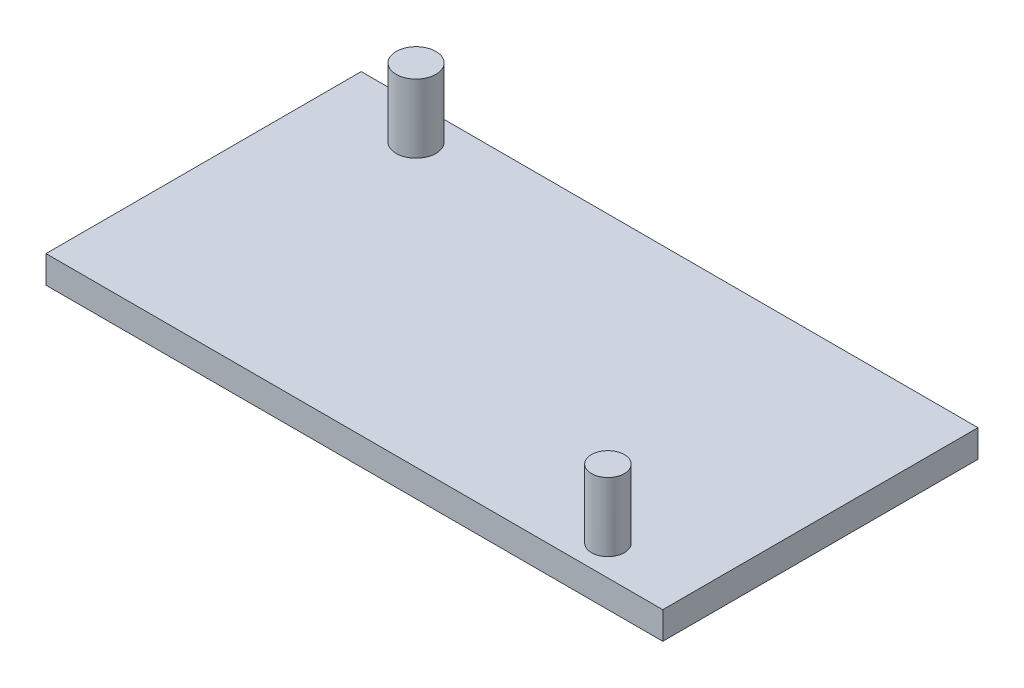
ISO-10303-21;
HEADER;
FILE_DESCRIPTION(('STEP AP214'),'2;1');
FILE_NAME('part.step','',(''),(''),'','','');
FILE_SCHEMA(('AUTOMOTIVE_DESIGN { 1 0 10303 214 1 1 1 1 }'));
ENDSEC;
DATA;
#1=APPLICATION_CONTEXT('core data for automotive mechanical design processes');
#2=APPLICATION_PROTOCOL_DEFINITION('international standard','automotive_design',2000,#1);
#3=PRODUCT_CONTEXT('',#1,'mechanical');
#4=PRODUCT('Part','Part','',(#3));
#5=PRODUCT_RELATED_PRODUCT_CATEGORY('part','',(#4));
#6=PRODUCT_DEFINITION_FORMATION('','',#4);
#7=PRODUCT_DEFINITION_CONTEXT('part definition',#1,'design');
#8=PRODUCT_DEFINITION('design','',#6,#7);
#9=PRODUCT_DEFINITION_SHAPE('','',#8);
#10=(LENGTH_UNIT() NAMED_UNIT(*) SI_UNIT(.MILLI.,.METRE.));
#11=(NAMED_UNIT(*) PLANE_ANGLE_UNIT() SI_UNIT($,.RADIAN.));
#12=(NAMED_UNIT(*) SI_UNIT($,.STERADIAN.) SOLID_ANGLE_UNIT());
#13=UNCERTAINTY_MEASURE_WITH_UNIT(LENGTH_MEASURE(1.E-05),#10,'distance_accuracy_value','');
#14=(GEOMETRIC_REPRESENTATION_CONTEXT(3) GLOBAL_UNCERTAINTY_ASSIGNED_CONTEXT((#13)) GLOBAL_UNIT_ASSIGNED_CONTEXT((#10,
#11,#12)) REPRESENTATION_CONTEXT('',''));
#15=CARTESIAN_POINT('',(0.,0.,0.));
#16=DIRECTION('',(0.,0.,1.));
#17=DIRECTION('',(1.,0.,0.));
#18=AXIS2_PLACEMENT_3D('',#15,#16,#17);
#19=CARTESIAN_POINT('',(0.,-2.,0.));
#20=DIRECTION('',(-1.,0.,0.));
#21=DIRECTION('',(0.,0.,1.));
#22=AXIS2_PLACEMENT_3D('',#19,#20,#21);
#23=PLANE('',#22);
#24=DIRECTION('',(0.,0.,1.));
#25=VECTOR('',#24,1.);
#26=CARTESIAN_POINT('',(0.,0.,0.));
#27=LINE('',#26,#25);
#28=CARTESIAN_POINT('',(0.,0.,-23.));
#29=VERTEX_POINT('',#28);
#30=CARTESIAN_POINT('',(0.,0.,0.));
#31=VERTEX_POINT('',#30);
#32=EDGE_CURVE('E101',#29,#31,#27,.T.);
#33=ORIENTED_EDGE('',*,*,#32,.F.);
#34=DIRECTION('',(0.,1.,0.));
#35=VECTOR('',#34,1.);
#36=CARTESIAN_POINT('',(0.,-2.,-23.));
#37=LINE('',#36,#35);
#38=CARTESIAN_POINT('',(0.,-2.,-23.));
#39=VERTEX_POINT('',#38);
#40=EDGE_CURVE('E49',#39,#29,#37,.T.);
#41=ORIENTED_EDGE('',*,*,#40,.F.);
#42=DIRECTION('',(0.,0.,1.));
#43=VECTOR('',#42,1.);
#44=CARTESIAN_POINT('',(0.,-2.,0.));
#45=LINE('',#44,#43);
#46=CARTESIAN_POINT('',(0.,-2.,0.));
#47=VERTEX_POINT('',#46);
#48=EDGE_CURVE('E94',#39,#47,#45,.T.);
#49=ORIENTED_EDGE('',*,*,#48,.T.);
#50=DIRECTION('',(0.,1.,0.));
#51=VECTOR('',#50,1.);
#52=CARTESIAN_POINT('',(0.,-2.,0.));
#53=LINE('',#52,#51);
#54=EDGE_CURVE('E77',#47,#31,#53,.T.);
#55=ORIENTED_EDGE('',*,*,#54,.T.);
#56=EDGE_LOOP('',(#33,#41,#49,#55));
#57=FACE_BOUND('',#56,.T.);
#58=ADVANCED_FACE('F33',(#57),#23,.T.);
#59=CARTESIAN_POINT('',(0.,-2.,-23.));
#60=DIRECTION('',(0.,0.,-1.));
#61=DIRECTION('',(-1.,0.,0.));
#62=AXIS2_PLACEMENT_3D('',#59,#60,#61);
#63=PLANE('',#62);
#64=DIRECTION('',(-1.,0.,0.));
#65=VECTOR('',#64,1.);
#66=CARTESIAN_POINT('',(0.,0.,-23.));
#67=LINE('',#66,#65);
#68=CARTESIAN_POINT('',(45.,0.,-23.));
#69=VERTEX_POINT('',#68);
#70=EDGE_CURVE('E96',#69,#29,#67,.T.);
#71=ORIENTED_EDGE('',*,*,#70,.F.);
#72=DIRECTION('',(0.,1.,0.));
#73=VECTOR('',#72,1.);
#74=CARTESIAN_POINT('',(45.,-2.,-23.));
#75=LINE('',#74,#73);
#76=CARTESIAN_POINT('',(45.,-2.,-23.));
#77=VERTEX_POINT('',#76);
#78=EDGE_CURVE('E66',#77,#69,#75,.T.);
#79=ORIENTED_EDGE('',*,*,#78,.F.);
#80=DIRECTION('',(-1.,0.,0.));
#81=VECTOR('',#80,1.);
#82=CARTESIAN_POINT('',(0.,-2.,-23.));
#83=LINE('',#82,#81);
#84=EDGE_CURVE('E91',#77,#39,#83,.T.);
#85=ORIENTED_EDGE('',*,*,#84,.T.);
#86=ORIENTED_EDGE('',*,*,#40,.T.);
#87=EDGE_LOOP('',(#71,#79,#85,#86));
#88=FACE_BOUND('',#87,.T.);
#89=ADVANCED_FACE('F122',(#88),#63,.T.);
#90=CARTESIAN_POINT('',(45.,-2.,0.));
#91=DIRECTION('',(1.,0.,0.));
#92=DIRECTION('',(0.,0.,-1.));
#93=AXIS2_PLACEMENT_3D('',#90,#91,#92);
#94=PLANE('',#93);
#95=DIRECTION('',(0.,0.,-1.));
#96=VECTOR('',#95,1.);
#97=CARTESIAN_POINT('',(45.,0.,0.));
#98=LINE('',#97,#96);
#99=CARTESIAN_POINT('',(45.,0.,0.));
#100=VERTEX_POINT('',#99);
#101=EDGE_CURVE('E85',#100,#69,#98,.T.);
#102=ORIENTED_EDGE('',*,*,#101,.F.);
#103=DIRECTION('',(0.,1.,0.));
#104=VECTOR('',#103,1.);
#105=CARTESIAN_POINT('',(45.,-2.,0.));
#106=LINE('',#105,#104);
#107=CARTESIAN_POINT('',(45.,-2.,0.));
#108=VERTEX_POINT('',#107);
#109=EDGE_CURVE('E80',#108,#100,#106,.T.);
#110=ORIENTED_EDGE('',*,*,#109,.F.);
#111=DIRECTION('',(0.,0.,-1.));
#112=VECTOR('',#111,1.);
#113=CARTESIAN_POINT('',(45.,-2.,0.));
#114=LINE('',#113,#112);
#115=EDGE_CURVE('E83',#108,#77,#114,.T.);
#116=ORIENTED_EDGE('',*,*,#115,.T.);
#117=ORIENTED_EDGE('',*,*,#78,.T.);
#118=EDGE_LOOP('',(#102,#110,#116,#117));
#119=FACE_BOUND('',#118,.T.);
#120=ADVANCED_FACE('F82',(#119),#94,.T.);
#121=CARTESIAN_POINT('',(0.,-2.,0.));
#122=DIRECTION('',(0.,0.,1.));
#123=DIRECTION('',(1.,0.,0.));
#124=AXIS2_PLACEMENT_3D('',#121,#122,#123);
#125=PLANE('',#124);
#126=DIRECTION('',(1.,0.,0.));
#127=VECTOR('',#126,1.);
#128=CARTESIAN_POINT('',(0.,0.,0.));
#129=LINE('',#128,#127);
#130=EDGE_CURVE('E104',#31,#100,#129,.T.);
#131=ORIENTED_EDGE('',*,*,#130,.F.);
#132=ORIENTED_EDGE('',*,*,#54,.F.);
#133=DIRECTION('',(1.,0.,0.));
#134=VECTOR('',#133,1.);
#135=CARTESIAN_POINT('',(0.,-2.,0.));
#136=LINE('',#135,#134);
#137=EDGE_CURVE('E90',#47,#108,#136,.T.);
#138=ORIENTED_EDGE('',*,*,#137,.T.);
#139=ORIENTED_EDGE('',*,*,#109,.T.);
#140=EDGE_LOOP('',(#131,#132,#138,#139));
#141=FACE_BOUND('',#140,.T.);
#142=ADVANCED_FACE('F93',(#141),#125,.T.);
#143=CARTESIAN_POINT('',(0.,-2.,0.));
#144=DIRECTION('',(0.,-1.,0.));
#145=DIRECTION('',(0.,0.,-1.));
#146=AXIS2_PLACEMENT_3D('',#143,#144,#145);
#147=PLANE('',#146);
#148=ORIENTED_EDGE('',*,*,#48,.F.);
#149=ORIENTED_EDGE('',*,*,#84,.F.);
#150=ORIENTED_EDGE('',*,*,#115,.F.);
#151=ORIENTED_EDGE('',*,*,#137,.F.);
#152=EDGE_LOOP('',(#148,#149,#150,#151));
#153=FACE_BOUND('',#152,.T.);
#154=ADVANCED_FACE('F89',(#153),#147,.T.);
#155=CARTESIAN_POINT('',(0.,0.,0.));
#156=DIRECTION('',(0.,-1.,0.));
#157=DIRECTION('',(0.,0.,-1.));
#158=AXIS2_PLACEMENT_3D('',#155,#156,#157);
#159=PLANE('',#158);
#160=CARTESIAN_POINT('',(6.45,0.,-20.5499922));
#161=DIRECTION('',(0.,-1.,0.));
#162=DIRECTION('',(0.,0.,-1.));
#163=AXIS2_PLACEMENT_3D('',#160,#161,#162);
#164=CIRCLE('',#163,1.45);
#165=CARTESIAN_POINT('',(6.45,0.,-21.9999922));
#166=VERTEX_POINT('',#165);
#167=EDGE_CURVE('E11',#166,#166,#164,.F.);
#168=ORIENTED_EDGE('',*,*,#167,.F.);
#169=EDGE_LOOP('',(#168));
#170=FACE_BOUND('',#169,.T.);
#171=CARTESIAN_POINT('',(38.8,0.,-2.2));
#172=DIRECTION('',(0.,-1.,0.));
#173=DIRECTION('',(0.,0.,-1.));
#174=AXIS2_PLACEMENT_3D('',#171,#172,#173);
#175=CIRCLE('',#174,1.1999976);
#176=CARTESIAN_POINT('',(38.8,0.,-3.3999976));
#177=VERTEX_POINT('',#176);
#178=EDGE_CURVE('E41',#177,#177,#175,.F.);
#179=ORIENTED_EDGE('',*,*,#178,.F.);
#180=EDGE_LOOP('',(#179));
#181=FACE_BOUND('',#180,.T.);
#182=ORIENTED_EDGE('',*,*,#32,.T.);
#183=ORIENTED_EDGE('',*,*,#130,.T.);
#184=ORIENTED_EDGE('',*,*,#101,.T.);
#185=ORIENTED_EDGE('',*,*,#70,.T.);
#186=EDGE_LOOP('',(#182,#183,#184,#185));
#187=FACE_BOUND('',#186,.T.);
#188=ADVANCED_FACE('F117',(#170,#181,#187),#159,.F.);
#189=CARTESIAN_POINT('',(38.8,5.,-2.2));
#190=DIRECTION('',(0.,-1.,0.));
#191=DIRECTION('',(0.,0.,-1.));
#192=AXIS2_PLACEMENT_3D('',#189,#190,#191);
#193=CYLINDRICAL_SURFACE('',#192,1.1999976);
#194=CARTESIAN_POINT('',(38.8,5.,-2.2));
#195=DIRECTION('',(0.,1.,0.));
#196=DIRECTION('',(0.,0.,1.));
#197=AXIS2_PLACEMENT_3D('',#194,#195,#196);
#198=CIRCLE('',#197,1.1999976);
#199=CARTESIAN_POINT('',(38.8,5.,-1.0000024));
#200=VERTEX_POINT('',#199);
#201=EDGE_CURVE('E105',#200,#200,#198,.T.);
#202=ORIENTED_EDGE('',*,*,#201,.F.);
#203=EDGE_LOOP('',(#202));
#204=FACE_BOUND('',#203,.T.);
#205=ORIENTED_EDGE('',*,*,#178,.T.);
#206=EDGE_LOOP('',(#205));
#207=FACE_BOUND('',#206,.T.);
#208=ADVANCED_FACE('F115',(#204,#207),#193,.T.);
#209=CARTESIAN_POINT('',(38.8,5.,-2.2));
#210=DIRECTION('',(0.,1.,0.));
#211=DIRECTION('',(0.,0.,1.));
#212=AXIS2_PLACEMENT_3D('',#209,#210,#211);
#213=PLANE('',#212);
#214=ORIENTED_EDGE('',*,*,#201,.T.);
#215=EDGE_LOOP('',(#214));
#216=FACE_BOUND('',#215,.T.);
#217=ADVANCED_FACE('F140',(#216),#213,.T.);
#218=CARTESIAN_POINT('',(6.45,5.,-20.5499922));
#219=DIRECTION('',(0.,-1.,0.));
#220=DIRECTION('',(0.,0.,-1.));
#221=AXIS2_PLACEMENT_3D('',#218,#219,#220);
#222=CYLINDRICAL_SURFACE('',#221,1.45);
#223=CARTESIAN_POINT('',(6.45,5.,-20.5499922));
#224=DIRECTION('',(0.,1.,0.));
#225=DIRECTION('',(0.,0.,1.));
#226=AXIS2_PLACEMENT_3D('',#223,#224,#225);
#227=CIRCLE('',#226,1.45);
#228=CARTESIAN_POINT('',(6.45,5.,-19.0999922));
#229=VERTEX_POINT('',#228);
#230=EDGE_CURVE('E156',#229,#229,#227,.T.);
#231=ORIENTED_EDGE('',*,*,#230,.F.);
#232=EDGE_LOOP('',(#231));
#233=FACE_BOUND('',#232,.T.);
#234=ORIENTED_EDGE('',*,*,#167,.T.);
#235=EDGE_LOOP('',(#234));
#236=FACE_BOUND('',#235,.T.);
#237=ADVANCED_FACE('F144',(#233,#236),#222,.T.);
#238=CARTESIAN_POINT('',(6.45,5.,-20.5499922));
#239=DIRECTION('',(0.,1.,0.));
#240=DIRECTION('',(0.,0.,1.));
#241=AXIS2_PLACEMENT_3D('',#238,#239,#240);
#242=PLANE('',#241);
#243=ORIENTED_EDGE('',*,*,#230,.T.);
#244=EDGE_LOOP('',(#243));
#245=FACE_BOUND('',#244,.T.);
#246=ADVANCED_FACE('F148',(#245),#242,.T.);
#247=CLOSED_SHELL('',(#58,#89,#120,#142,#154,#188,#208,#217,#237,#246));
#248=MANIFOLD_SOLID_BREP('B2',#247);
#249=ADVANCED_BREP_SHAPE_REPRESENTATION('',(#18,#248),#14);
#250=SHAPE_DEFINITION_REPRESENTATION(#9,#249);
ENDSEC;
END-ISO-10303-21;
